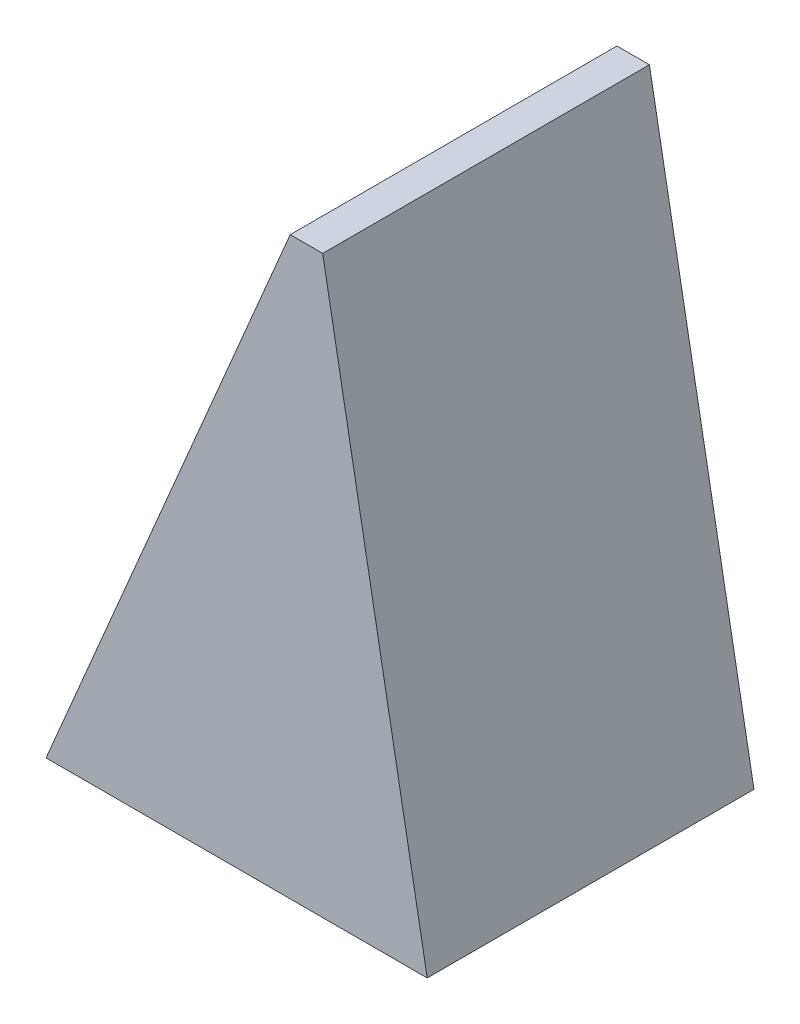
ISO-10303-21;
HEADER;
FILE_DESCRIPTION(('STEP AP214'),'2;1');
FILE_NAME('part.step','',(''),(''),'','','');
FILE_SCHEMA(('AUTOMOTIVE_DESIGN { 1 0 10303 214 1 1 1 1 }'));
ENDSEC;
DATA;
#1=APPLICATION_CONTEXT('core data for automotive mechanical design processes');
#2=APPLICATION_PROTOCOL_DEFINITION('international standard','automotive_design',2000,#1);
#3=PRODUCT_CONTEXT('',#1,'mechanical');
#4=PRODUCT('Part','Part','',(#3));
#5=PRODUCT_RELATED_PRODUCT_CATEGORY('part','',(#4));
#6=PRODUCT_DEFINITION_FORMATION('','',#4);
#7=PRODUCT_DEFINITION_CONTEXT('part definition',#1,'design');
#8=PRODUCT_DEFINITION('design','',#6,#7);
#9=PRODUCT_DEFINITION_SHAPE('','',#8);
#10=(LENGTH_UNIT() NAMED_UNIT(*) SI_UNIT(.MILLI.,.METRE.));
#11=(NAMED_UNIT(*) PLANE_ANGLE_UNIT() SI_UNIT($,.RADIAN.));
#12=(NAMED_UNIT(*) SI_UNIT($,.STERADIAN.) SOLID_ANGLE_UNIT());
#13=UNCERTAINTY_MEASURE_WITH_UNIT(LENGTH_MEASURE(1.E-05),#10,'distance_accuracy_value','');
#14=(GEOMETRIC_REPRESENTATION_CONTEXT(3) GLOBAL_UNCERTAINTY_ASSIGNED_CONTEXT((#13)) GLOBAL_UNIT_ASSIGNED_CONTEXT((#10,
#11,#12)) REPRESENTATION_CONTEXT('',''));
#15=CARTESIAN_POINT('',(0.,0.,0.));
#16=DIRECTION('',(0.,0.,1.));
#17=DIRECTION('',(1.,0.,0.));
#18=AXIS2_PLACEMENT_3D('',#15,#16,#17);
#19=CARTESIAN_POINT('',(0.,0.,0.6));
#20=DIRECTION('',(0.920504853452441,-0.390731128489271,0.));
#21=DIRECTION('',(0.390731128489271,0.920504853452442,0.));
#22=AXIS2_PLACEMENT_3D('',#19,#20,#21);
#23=PLANE('',#22);
#24=DIRECTION('',(-0.390731128489271,-0.920504853452441,0.));
#25=VECTOR('',#24,1.);
#26=CARTESIAN_POINT('',(0.,0.,0.6));
#27=LINE('',#26,#25);
#28=CARTESIAN_POINT('',(0.448387693736882,1.0563352090963,0.6));
#29=VERTEX_POINT('',#28);
#30=CARTESIAN_POINT('',(0.,0.,0.6));
#31=VERTEX_POINT('',#30);
#32=EDGE_CURVE('E73',#29,#31,#27,.T.);
#33=ORIENTED_EDGE('',*,*,#32,.F.);
#34=DIRECTION('',(0.,0.,-1.));
#35=VECTOR('',#34,1.);
#36=CARTESIAN_POINT('',(0.448387693736882,1.0563352090963,0.6));
#37=LINE('',#36,#35);
#38=CARTESIAN_POINT('',(0.448387693736882,1.0563352090963,0.));
#39=VERTEX_POINT('',#38);
#40=EDGE_CURVE('E95',#29,#39,#37,.T.);
#41=ORIENTED_EDGE('',*,*,#40,.T.);
#42=DIRECTION('',(-0.390731128489271,-0.920504853452441,0.));
#43=VECTOR('',#42,1.);
#44=CARTESIAN_POINT('',(0.,0.,0.));
#45=LINE('',#44,#43);
#46=CARTESIAN_POINT('',(0.,0.,0.));
#47=VERTEX_POINT('',#46);
#48=EDGE_CURVE('E93',#39,#47,#45,.T.);
#49=ORIENTED_EDGE('',*,*,#48,.T.);
#50=DIRECTION('',(0.,0.,-1.));
#51=VECTOR('',#50,1.);
#52=CARTESIAN_POINT('',(0.,0.,0.6));
#53=LINE('',#52,#51);
#54=EDGE_CURVE('E88',#31,#47,#53,.T.);
#55=ORIENTED_EDGE('',*,*,#54,.F.);
#56=EDGE_LOOP('',(#33,#41,#49,#55));
#57=FACE_BOUND('',#56,.T.);
#58=ADVANCED_FACE('F33',(#57),#23,.F.);
#59=CARTESIAN_POINT('',(0.,0.,0.6));
#60=DIRECTION('',(0.,1.,0.));
#61=DIRECTION('',(0.,0.,1.));
#62=AXIS2_PLACEMENT_3D('',#59,#60,#61);
#63=PLANE('',#62);
#64=DIRECTION('',(1.,0.,0.));
#65=VECTOR('',#64,1.);
#66=CARTESIAN_POINT('',(0.,0.,0.));
#67=LINE('',#66,#65);
#68=CARTESIAN_POINT('',(0.699999999999999,0.,0.));
#69=VERTEX_POINT('',#68);
#70=EDGE_CURVE('E102',#47,#69,#67,.T.);
#71=ORIENTED_EDGE('',*,*,#70,.T.);
#72=DIRECTION('',(0.,0.,-1.));
#73=VECTOR('',#72,1.);
#74=CARTESIAN_POINT('',(0.699999999999999,0.,0.6));
#75=LINE('',#74,#73);
#76=CARTESIAN_POINT('',(0.699999999999999,0.,0.6));
#77=VERTEX_POINT('',#76);
#78=EDGE_CURVE('E90',#77,#69,#75,.T.);
#79=ORIENTED_EDGE('',*,*,#78,.F.);
#80=DIRECTION('',(1.,0.,0.));
#81=VECTOR('',#80,1.);
#82=CARTESIAN_POINT('',(0.,0.,0.6));
#83=LINE('',#82,#81);
#84=EDGE_CURVE('E76',#31,#77,#83,.T.);
#85=ORIENTED_EDGE('',*,*,#84,.F.);
#86=ORIENTED_EDGE('',*,*,#54,.T.);
#87=EDGE_LOOP('',(#71,#79,#85,#86));
#88=FACE_BOUND('',#87,.T.);
#89=ADVANCED_FACE('F87',(#88),#63,.F.);
#90=CARTESIAN_POINT('',(0.699999999999999,0.,0.6));
#91=DIRECTION('',(-0.983885037933541,-0.178802215116354,0.));
#92=DIRECTION('',(0.178802215116354,-0.983885037933541,0.));
#93=AXIS2_PLACEMENT_3D('',#90,#91,#92);
#94=PLANE('',#93);
#95=DIRECTION('',(-0.178802215116354,0.983885037933541,0.));
#96=VECTOR('',#95,1.);
#97=CARTESIAN_POINT('',(0.699999999999999,0.,0.));
#98=LINE('',#97,#96);
#99=CARTESIAN_POINT('',(0.508031357313339,1.0563352090963,0.));
#100=VERTEX_POINT('',#99);
#101=EDGE_CURVE('E83',#69,#100,#98,.T.);
#102=ORIENTED_EDGE('',*,*,#101,.T.);
#103=DIRECTION('',(0.,0.,1.));
#104=VECTOR('',#103,1.);
#105=CARTESIAN_POINT('',(0.508031357313339,1.0563352090963,0.6));
#106=LINE('',#105,#104);
#107=CARTESIAN_POINT('',(0.508031357313339,1.0563352090963,0.6));
#108=VERTEX_POINT('',#107);
#109=EDGE_CURVE('E41',#100,#108,#106,.T.);
#110=ORIENTED_EDGE('',*,*,#109,.T.);
#111=DIRECTION('',(-0.178802215116354,0.983885037933541,0.));
#112=VECTOR('',#111,1.);
#113=CARTESIAN_POINT('',(0.699999999999999,0.,0.6));
#114=LINE('',#113,#112);
#115=EDGE_CURVE('E91',#77,#108,#114,.T.);
#116=ORIENTED_EDGE('',*,*,#115,.F.);
#117=ORIENTED_EDGE('',*,*,#78,.T.);
#118=EDGE_LOOP('',(#102,#110,#116,#117));
#119=FACE_BOUND('',#118,.T.);
#120=ADVANCED_FACE('F107',(#119),#94,.F.);
#121=CARTESIAN_POINT('',(0.,0.,0.6));
#122=DIRECTION('',(0.,0.,-1.));
#123=DIRECTION('',(-1.,0.,0.));
#124=AXIS2_PLACEMENT_3D('',#121,#122,#123);
#125=PLANE('',#124);
#126=ORIENTED_EDGE('',*,*,#115,.T.);
#127=DIRECTION('',(1.,0.,0.));
#128=VECTOR('',#127,1.);
#129=CARTESIAN_POINT('',(0.448387693736882,1.0563352090963,0.6));
#130=LINE('',#129,#128);
#131=EDGE_CURVE('E11',#108,#29,#130,.F.);
#132=ORIENTED_EDGE('',*,*,#131,.T.);
#133=ORIENTED_EDGE('',*,*,#32,.T.);
#134=ORIENTED_EDGE('',*,*,#84,.T.);
#135=EDGE_LOOP('',(#126,#132,#133,#134));
#136=FACE_BOUND('',#135,.T.);
#137=ADVANCED_FACE('F75',(#136),#125,.F.);
#138=CARTESIAN_POINT('',(0.,0.,0.));
#139=DIRECTION('',(0.,0.,-1.));
#140=DIRECTION('',(-1.,0.,0.));
#141=AXIS2_PLACEMENT_3D('',#138,#139,#140);
#142=PLANE('',#141);
#143=ORIENTED_EDGE('',*,*,#48,.F.);
#144=DIRECTION('',(-1.,0.,0.));
#145=VECTOR('',#144,1.);
#146=CARTESIAN_POINT('',(0.,1.0563352090963,0.));
#147=LINE('',#146,#145);
#148=EDGE_CURVE('E55',#39,#100,#147,.F.);
#149=ORIENTED_EDGE('',*,*,#148,.T.);
#150=ORIENTED_EDGE('',*,*,#101,.F.);
#151=ORIENTED_EDGE('',*,*,#70,.F.);
#152=EDGE_LOOP('',(#143,#149,#150,#151));
#153=FACE_BOUND('',#152,.T.);
#154=ADVANCED_FACE('F106',(#153),#142,.T.);
#155=CARTESIAN_POINT('',(0.448387693736882,1.0563352090963,0.6));
#156=DIRECTION('',(0.,-1.,0.));
#157=DIRECTION('',(0.,0.,-1.));
#158=AXIS2_PLACEMENT_3D('',#155,#156,#157);
#159=PLANE('',#158);
#160=ORIENTED_EDGE('',*,*,#131,.F.);
#161=ORIENTED_EDGE('',*,*,#109,.F.);
#162=ORIENTED_EDGE('',*,*,#148,.F.);
#163=ORIENTED_EDGE('',*,*,#40,.F.);
#164=EDGE_LOOP('',(#160,#161,#162,#163));
#165=FACE_BOUND('',#164,.T.);
#166=ADVANCED_FACE('F35',(#165),#159,.F.);
#167=CLOSED_SHELL('',(#58,#89,#120,#137,#154,#166));
#168=MANIFOLD_SOLID_BREP('B2',#167);
#169=ADVANCED_BREP_SHAPE_REPRESENTATION('',(#18,#168),#14);
#170=SHAPE_DEFINITION_REPRESENTATION(#9,#169);
ENDSEC;
END-ISO-10303-21;
